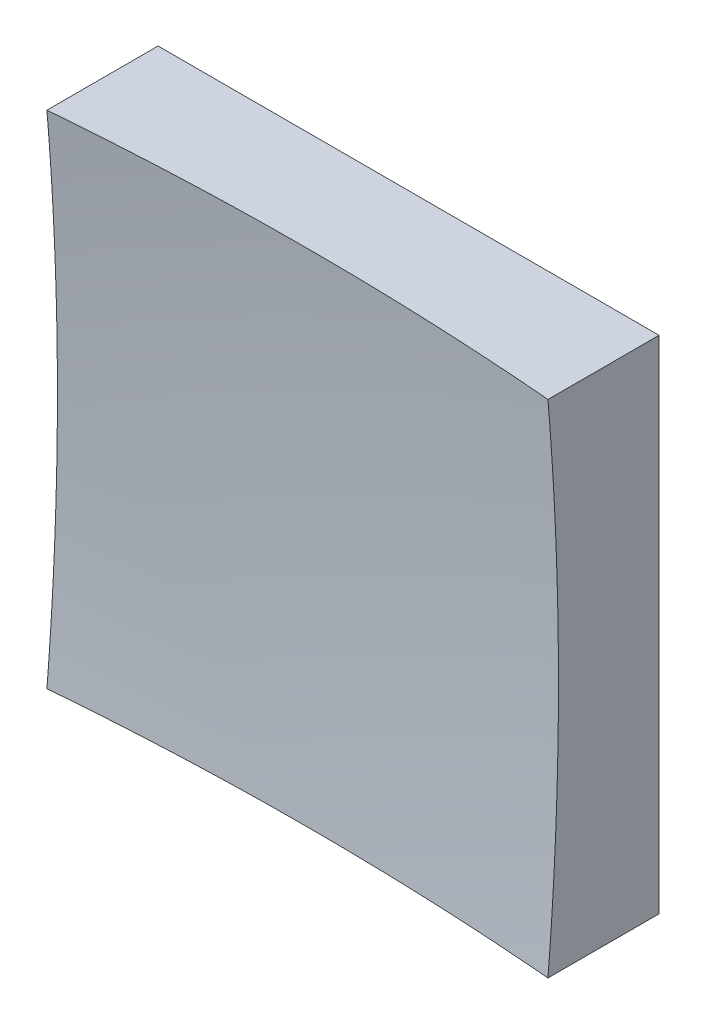
ISO-10303-21;
HEADER;
FILE_DESCRIPTION(('STEP AP214'),'2;1');
FILE_NAME('part.step','',(''),(''),'','','');
FILE_SCHEMA(('AUTOMOTIVE_DESIGN { 1 0 10303 214 1 1 1 1 }'));
ENDSEC;
DATA;
#1=APPLICATION_CONTEXT('core data for automotive mechanical design processes');
#2=APPLICATION_PROTOCOL_DEFINITION('international standard','automotive_design',2000,#1);
#3=PRODUCT_CONTEXT('',#1,'mechanical');
#4=PRODUCT('Part','Part','',(#3));
#5=PRODUCT_RELATED_PRODUCT_CATEGORY('part','',(#4));
#6=PRODUCT_DEFINITION_FORMATION('','',#4);
#7=PRODUCT_DEFINITION_CONTEXT('part definition',#1,'design');
#8=PRODUCT_DEFINITION('design','',#6,#7);
#9=PRODUCT_DEFINITION_SHAPE('','',#8);
#10=(LENGTH_UNIT() NAMED_UNIT(*) SI_UNIT(.MILLI.,.METRE.));
#11=(NAMED_UNIT(*) PLANE_ANGLE_UNIT() SI_UNIT($,.RADIAN.));
#12=(NAMED_UNIT(*) SI_UNIT($,.STERADIAN.) SOLID_ANGLE_UNIT());
#13=UNCERTAINTY_MEASURE_WITH_UNIT(LENGTH_MEASURE(1.E-05),#10,'distance_accuracy_value','');
#14=(GEOMETRIC_REPRESENTATION_CONTEXT(3) GLOBAL_UNCERTAINTY_ASSIGNED_CONTEXT((#13)) GLOBAL_UNIT_ASSIGNED_CONTEXT((#10,
#11,#12)) REPRESENTATION_CONTEXT('',''));
#15=CARTESIAN_POINT('',(0.,0.,0.));
#16=DIRECTION('',(0.,0.,1.));
#17=DIRECTION('',(1.,0.,0.));
#18=AXIS2_PLACEMENT_3D('',#15,#16,#17);
#19=CARTESIAN_POINT('',(-25.,25.,50.));
#20=DIRECTION('',(0.,1.,0.));
#21=DIRECTION('',(0.,0.,1.));
#22=AXIS2_PLACEMENT_3D('',#19,#20,#21);
#23=PLANE('',#22);
#24=CARTESIAN_POINT('',(0.,25.,309.));
#25=DIRECTION('',(0.,1.,0.));
#26=DIRECTION('',(0.,0.,1.));
#27=AXIS2_PLACEMENT_3D('',#24,#25,#26);
#28=CIRCLE('',#27,298.956518577535);
#29=CARTESIAN_POINT('',(25.,25.,11.0906178046755));
#30=VERTEX_POINT('',#29);
#31=CARTESIAN_POINT('',(-25.,25.,11.0906178046755));
#32=VERTEX_POINT('',#31);
#33=EDGE_CURVE('E79',#30,#32,#28,.T.);
#34=ORIENTED_EDGE('',*,*,#33,.F.);
#35=DIRECTION('',(0.,0.,-1.));
#36=VECTOR('',#35,1.);
#37=CARTESIAN_POINT('',(25.,25.,50.));
#38=LINE('',#37,#36);
#39=CARTESIAN_POINT('',(25.,25.,0.));
#40=VERTEX_POINT('',#39);
#41=EDGE_CURVE('E85',#30,#40,#38,.T.);
#42=ORIENTED_EDGE('',*,*,#41,.T.);
#43=DIRECTION('',(1.,0.,0.));
#44=VECTOR('',#43,1.);
#45=CARTESIAN_POINT('',(-25.,25.,0.));
#46=LINE('',#45,#44);
#47=CARTESIAN_POINT('',(-25.,25.,0.));
#48=VERTEX_POINT('',#47);
#49=EDGE_CURVE('E88',#48,#40,#46,.T.);
#50=ORIENTED_EDGE('',*,*,#49,.F.);
#51=DIRECTION('',(0.,0.,-1.));
#52=VECTOR('',#51,1.);
#53=CARTESIAN_POINT('',(-25.,25.,50.));
#54=LINE('',#53,#52);
#55=EDGE_CURVE('E47',#32,#48,#54,.T.);
#56=ORIENTED_EDGE('',*,*,#55,.F.);
#57=EDGE_LOOP('',(#34,#42,#50,#56));
#58=FACE_BOUND('',#57,.T.);
#59=ADVANCED_FACE('F39',(#58),#23,.T.);
#60=CARTESIAN_POINT('',(-25.,25.,50.));
#61=DIRECTION('',(1.,0.,0.));
#62=DIRECTION('',(0.,1.,0.));
#63=AXIS2_PLACEMENT_3D('',#60,#61,#62);
#64=PLANE('',#63);
#65=DIRECTION('',(0.,0.,-1.));
#66=VECTOR('',#65,1.);
#67=CARTESIAN_POINT('',(-25.,-25.,50.));
#68=LINE('',#67,#66);
#69=CARTESIAN_POINT('',(-25.,-25.,11.0906178046755));
#70=VERTEX_POINT('',#69);
#71=CARTESIAN_POINT('',(-25.,-25.,0.));
#72=VERTEX_POINT('',#71);
#73=EDGE_CURVE('E100',#70,#72,#68,.T.);
#74=ORIENTED_EDGE('',*,*,#73,.F.);
#75=CARTESIAN_POINT('',(-25.,0.,309.));
#76=DIRECTION('',(1.,0.,0.));
#77=DIRECTION('',(0.,1.,0.));
#78=AXIS2_PLACEMENT_3D('',#75,#76,#77);
#79=CIRCLE('',#78,298.956518577535);
#80=EDGE_CURVE('E89',#70,#32,#79,.T.);
#81=ORIENTED_EDGE('',*,*,#80,.T.);
#82=ORIENTED_EDGE('',*,*,#55,.T.);
#83=DIRECTION('',(0.,-1.,0.));
#84=VECTOR('',#83,1.);
#85=CARTESIAN_POINT('',(-25.,25.,0.));
#86=LINE('',#85,#84);
#87=EDGE_CURVE('E97',#48,#72,#86,.T.);
#88=ORIENTED_EDGE('',*,*,#87,.T.);
#89=EDGE_LOOP('',(#74,#81,#82,#88));
#90=FACE_BOUND('',#89,.T.);
#91=ADVANCED_FACE('F122',(#90),#64,.F.);
#92=CARTESIAN_POINT('',(-25.,-25.,50.));
#93=DIRECTION('',(0.,1.,0.));
#94=DIRECTION('',(0.,0.,1.));
#95=AXIS2_PLACEMENT_3D('',#92,#93,#94);
#96=PLANE('',#95);
#97=DIRECTION('',(0.,0.,-1.));
#98=VECTOR('',#97,1.);
#99=CARTESIAN_POINT('',(25.,-25.,50.));
#100=LINE('',#99,#98);
#101=CARTESIAN_POINT('',(25.,-25.,11.0906178046755));
#102=VERTEX_POINT('',#101);
#103=CARTESIAN_POINT('',(25.,-25.,0.));
#104=VERTEX_POINT('',#103);
#105=EDGE_CURVE('E96',#102,#104,#100,.T.);
#106=ORIENTED_EDGE('',*,*,#105,.F.);
#107=CARTESIAN_POINT('',(0.,-25.,309.));
#108=DIRECTION('',(0.,1.,0.));
#109=DIRECTION('',(0.,0.,1.));
#110=AXIS2_PLACEMENT_3D('',#107,#108,#109);
#111=CIRCLE('',#110,298.956518577535);
#112=EDGE_CURVE('E53',#102,#70,#111,.T.);
#113=ORIENTED_EDGE('',*,*,#112,.T.);
#114=ORIENTED_EDGE('',*,*,#73,.T.);
#115=DIRECTION('',(1.,0.,0.));
#116=VECTOR('',#115,1.);
#117=CARTESIAN_POINT('',(-25.,-25.,0.));
#118=LINE('',#117,#116);
#119=EDGE_CURVE('E102',#72,#104,#118,.T.);
#120=ORIENTED_EDGE('',*,*,#119,.T.);
#121=EDGE_LOOP('',(#106,#113,#114,#120));
#122=FACE_BOUND('',#121,.T.);
#123=ADVANCED_FACE('F121',(#122),#96,.F.);
#124=CARTESIAN_POINT('',(25.,25.,50.));
#125=DIRECTION('',(1.,0.,0.));
#126=DIRECTION('',(0.,1.,0.));
#127=AXIS2_PLACEMENT_3D('',#124,#125,#126);
#128=PLANE('',#127);
#129=CARTESIAN_POINT('',(25.,0.,309.));
#130=DIRECTION('',(1.,0.,0.));
#131=DIRECTION('',(0.,1.,0.));
#132=AXIS2_PLACEMENT_3D('',#129,#130,#131);
#133=CIRCLE('',#132,298.956518577535);
#134=EDGE_CURVE('E11',#102,#30,#133,.T.);
#135=ORIENTED_EDGE('',*,*,#134,.F.);
#136=ORIENTED_EDGE('',*,*,#105,.T.);
#137=DIRECTION('',(0.,-1.,0.));
#138=VECTOR('',#137,1.);
#139=CARTESIAN_POINT('',(25.,25.,0.));
#140=LINE('',#139,#138);
#141=EDGE_CURVE('E93',#40,#104,#140,.T.);
#142=ORIENTED_EDGE('',*,*,#141,.F.);
#143=ORIENTED_EDGE('',*,*,#41,.F.);
#144=EDGE_LOOP('',(#135,#136,#142,#143));
#145=FACE_BOUND('',#144,.T.);
#146=ADVANCED_FACE('F91',(#145),#128,.T.);
#147=CARTESIAN_POINT('',(0.,0.,0.));
#148=DIRECTION('',(0.,0.,-1.));
#149=DIRECTION('',(-1.,0.,0.));
#150=AXIS2_PLACEMENT_3D('',#147,#148,#149);
#151=PLANE('',#150);
#152=ORIENTED_EDGE('',*,*,#49,.T.);
#153=ORIENTED_EDGE('',*,*,#141,.T.);
#154=ORIENTED_EDGE('',*,*,#119,.F.);
#155=ORIENTED_EDGE('',*,*,#87,.F.);
#156=EDGE_LOOP('',(#152,#153,#154,#155));
#157=FACE_BOUND('',#156,.T.);
#158=ADVANCED_FACE('F125',(#157),#151,.T.);
#159=CARTESIAN_POINT('',(0.,0.,309.));
#160=DIRECTION('',(0.,0.,1.));
#161=DIRECTION('',(1.,0.,0.));
#162=AXIS2_PLACEMENT_3D('',#159,#160,#161);
#163=SPHERICAL_SURFACE('',#162,300.);
#164=ORIENTED_EDGE('',*,*,#33,.T.);
#165=ORIENTED_EDGE('',*,*,#80,.F.);
#166=ORIENTED_EDGE('',*,*,#112,.F.);
#167=ORIENTED_EDGE('',*,*,#134,.T.);
#168=EDGE_LOOP('',(#164,#165,#166,#167));
#169=FACE_BOUND('',#168,.T.);
#170=ADVANCED_FACE('F78',(#169),#163,.F.);
#171=CLOSED_SHELL('',(#59,#91,#123,#146,#158,#170));
#172=MANIFOLD_SOLID_BREP('B2',#171);
#173=ADVANCED_BREP_SHAPE_REPRESENTATION('',(#18,#172),#14);
#174=SHAPE_DEFINITION_REPRESENTATION(#9,#173);
ENDSEC;
END-ISO-10303-21;
